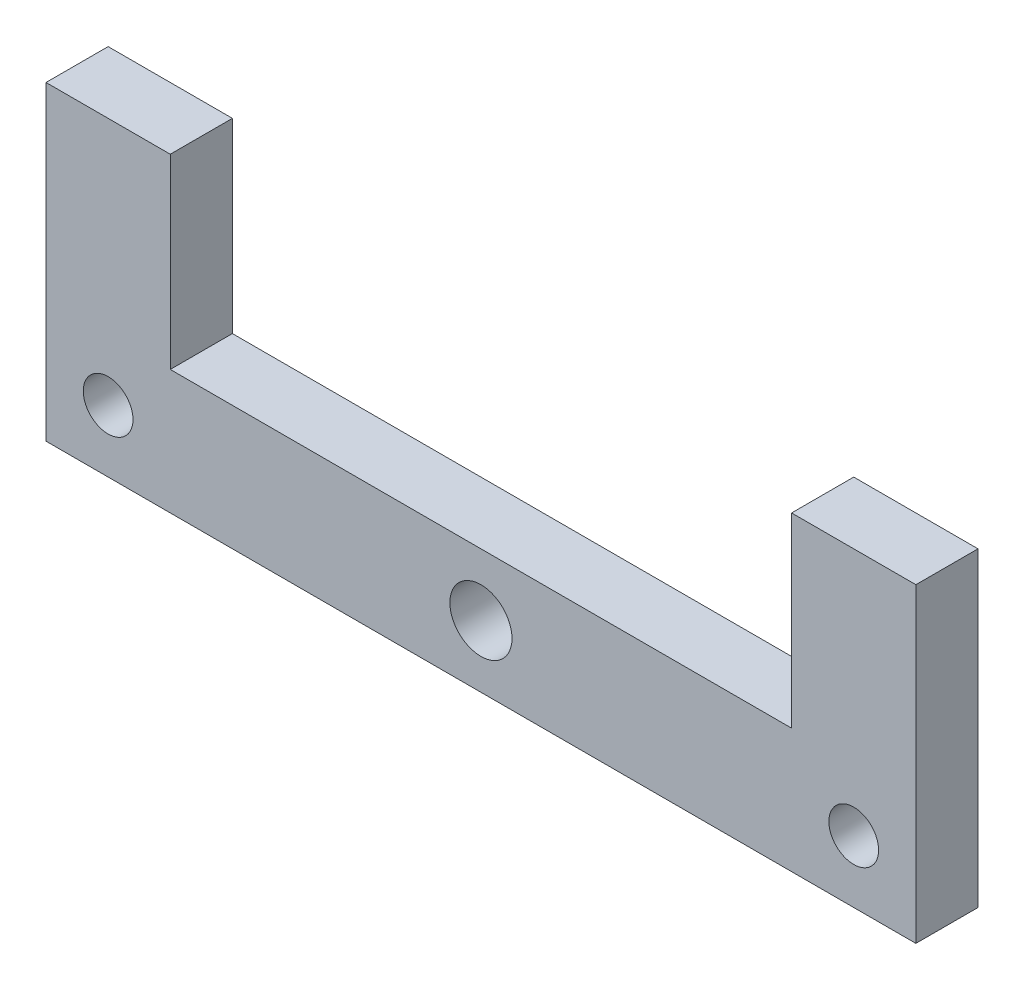
ISO-10303-21;
HEADER;
FILE_DESCRIPTION(('STEP AP214'),'2;1');
FILE_NAME('part.step','',(''),(''),'','','');
FILE_SCHEMA(('AUTOMOTIVE_DESIGN { 1 0 10303 214 1 1 1 1 }'));
ENDSEC;
DATA;
#1=APPLICATION_CONTEXT('core data for automotive mechanical design processes');
#2=APPLICATION_PROTOCOL_DEFINITION('international standard','automotive_design',2000,#1);
#3=PRODUCT_CONTEXT('',#1,'mechanical');
#4=PRODUCT('Part','Part','',(#3));
#5=PRODUCT_RELATED_PRODUCT_CATEGORY('part','',(#4));
#6=PRODUCT_DEFINITION_FORMATION('','',#4);
#7=PRODUCT_DEFINITION_CONTEXT('part definition',#1,'design');
#8=PRODUCT_DEFINITION('design','',#6,#7);
#9=PRODUCT_DEFINITION_SHAPE('','',#8);
#10=(LENGTH_UNIT() NAMED_UNIT(*) SI_UNIT(.MILLI.,.METRE.));
#11=(NAMED_UNIT(*) PLANE_ANGLE_UNIT() SI_UNIT($,.RADIAN.));
#12=(NAMED_UNIT(*) SI_UNIT($,.STERADIAN.) SOLID_ANGLE_UNIT());
#13=UNCERTAINTY_MEASURE_WITH_UNIT(LENGTH_MEASURE(1.E-05),#10,'distance_accuracy_value','');
#14=(GEOMETRIC_REPRESENTATION_CONTEXT(3) GLOBAL_UNCERTAINTY_ASSIGNED_CONTEXT((#13)) GLOBAL_UNIT_ASSIGNED_CONTEXT((#10,
#11,#12)) REPRESENTATION_CONTEXT('',''));
#15=CARTESIAN_POINT('',(0.,0.,0.));
#16=DIRECTION('',(0.,0.,1.));
#17=DIRECTION('',(1.,0.,0.));
#18=AXIS2_PLACEMENT_3D('',#15,#16,#17);
#19=CARTESIAN_POINT('',(50.,-100.772299585195,10.));
#20=DIRECTION('',(-1.,0.,0.));
#21=DIRECTION('',(0.,0.,1.));
#22=AXIS2_PLACEMENT_3D('',#19,#20,#21);
#23=PLANE('',#22);
#24=DIRECTION('',(0.,1.,0.));
#25=VECTOR('',#24,1.);
#26=CARTESIAN_POINT('',(50.,-100.772299585195,0.));
#27=LINE('',#26,#25);
#28=CARTESIAN_POINT('',(50.,9.99999999999998,0.));
#29=VERTEX_POINT('',#28);
#30=CARTESIAN_POINT('',(50.,40.,0.));
#31=VERTEX_POINT('',#30);
#32=EDGE_CURVE('E138',#29,#31,#27,.T.);
#33=ORIENTED_EDGE('',*,*,#32,.F.);
#34=DIRECTION('',(0.,0.,-1.));
#35=VECTOR('',#34,1.);
#36=CARTESIAN_POINT('',(50.,9.99999999999998,10.));
#37=LINE('',#36,#35);
#38=CARTESIAN_POINT('',(50.,9.99999999999998,10.));
#39=VERTEX_POINT('',#38);
#40=EDGE_CURVE('E11',#39,#29,#37,.T.);
#41=ORIENTED_EDGE('',*,*,#40,.F.);
#42=DIRECTION('',(0.,1.,0.));
#43=VECTOR('',#42,1.);
#44=CARTESIAN_POINT('',(50.,-100.772299585195,10.));
#45=LINE('',#44,#43);
#46=CARTESIAN_POINT('',(50.,40.,10.));
#47=VERTEX_POINT('',#46);
#48=EDGE_CURVE('E181',#39,#47,#45,.T.);
#49=ORIENTED_EDGE('',*,*,#48,.T.);
#50=DIRECTION('',(0.,0.,-1.));
#51=VECTOR('',#50,1.);
#52=CARTESIAN_POINT('',(50.,40.,10.));
#53=LINE('',#52,#51);
#54=EDGE_CURVE('E86',#47,#31,#53,.T.);
#55=ORIENTED_EDGE('',*,*,#54,.T.);
#56=EDGE_LOOP('',(#33,#41,#49,#55));
#57=FACE_BOUND('',#56,.T.);
#58=ADVANCED_FACE('F35',(#57),#23,.T.);
#59=CARTESIAN_POINT('',(0.,9.99999999999998,10.));
#60=DIRECTION('',(0.,1.,0.));
#61=DIRECTION('',(-1.,0.,0.));
#62=AXIS2_PLACEMENT_3D('',#59,#60,#61);
#63=PLANE('',#62);
#64=DIRECTION('',(1.,0.,0.));
#65=VECTOR('',#64,1.);
#66=CARTESIAN_POINT('',(0.,9.99999999999998,0.));
#67=LINE('',#66,#65);
#68=CARTESIAN_POINT('',(-50.,9.99999999999998,0.));
#69=VERTEX_POINT('',#68);
#70=EDGE_CURVE('E141',#69,#29,#67,.T.);
#71=ORIENTED_EDGE('',*,*,#70,.F.);
#72=DIRECTION('',(0.,0.,-1.));
#73=VECTOR('',#72,1.);
#74=CARTESIAN_POINT('',(-50.,9.99999999999998,10.));
#75=LINE('',#74,#73);
#76=CARTESIAN_POINT('',(-50.,9.99999999999998,10.));
#77=VERTEX_POINT('',#76);
#78=EDGE_CURVE('E44',#77,#69,#75,.T.);
#79=ORIENTED_EDGE('',*,*,#78,.F.);
#80=DIRECTION('',(1.,0.,0.));
#81=VECTOR('',#80,1.);
#82=CARTESIAN_POINT('',(0.,9.99999999999998,10.));
#83=LINE('',#82,#81);
#84=EDGE_CURVE('E179',#77,#39,#83,.T.);
#85=ORIENTED_EDGE('',*,*,#84,.T.);
#86=ORIENTED_EDGE('',*,*,#40,.T.);
#87=EDGE_LOOP('',(#71,#79,#85,#86));
#88=FACE_BOUND('',#87,.T.);
#89=ADVANCED_FACE('F178',(#88),#63,.T.);
#90=CARTESIAN_POINT('',(-50.,-100.772299585195,10.));
#91=DIRECTION('',(-1.,0.,0.));
#92=DIRECTION('',(0.,0.,1.));
#93=AXIS2_PLACEMENT_3D('',#90,#91,#92);
#94=PLANE('',#93);
#95=DIRECTION('',(0.,1.,0.));
#96=VECTOR('',#95,1.);
#97=CARTESIAN_POINT('',(-50.,-100.772299585195,0.));
#98=LINE('',#97,#96);
#99=CARTESIAN_POINT('',(-50.,40.,0.));
#100=VERTEX_POINT('',#99);
#101=EDGE_CURVE('E144',#69,#100,#98,.T.);
#102=ORIENTED_EDGE('',*,*,#101,.T.);
#103=DIRECTION('',(0.,0.,-1.));
#104=VECTOR('',#103,1.);
#105=CARTESIAN_POINT('',(-50.,40.,10.));
#106=LINE('',#105,#104);
#107=CARTESIAN_POINT('',(-50.,40.,10.));
#108=VERTEX_POINT('',#107);
#109=EDGE_CURVE('E164',#108,#100,#106,.T.);
#110=ORIENTED_EDGE('',*,*,#109,.F.);
#111=DIRECTION('',(0.,1.,0.));
#112=VECTOR('',#111,1.);
#113=CARTESIAN_POINT('',(-50.,-100.772299585195,10.));
#114=LINE('',#113,#112);
#115=EDGE_CURVE('E170',#77,#108,#114,.T.);
#116=ORIENTED_EDGE('',*,*,#115,.F.);
#117=ORIENTED_EDGE('',*,*,#78,.T.);
#118=EDGE_LOOP('',(#102,#110,#116,#117));
#119=FACE_BOUND('',#118,.T.);
#120=ADVANCED_FACE('F168',(#119),#94,.F.);
#121=CARTESIAN_POINT('',(0.,40.,10.));
#122=DIRECTION('',(0.,1.,0.));
#123=DIRECTION('',(0.,0.,1.));
#124=AXIS2_PLACEMENT_3D('',#121,#122,#123);
#125=PLANE('',#124);
#126=DIRECTION('',(1.,0.,0.));
#127=VECTOR('',#126,1.);
#128=CARTESIAN_POINT('',(0.,40.,0.));
#129=LINE('',#128,#127);
#130=CARTESIAN_POINT('',(-70.,40.,0.));
#131=VERTEX_POINT('',#130);
#132=EDGE_CURVE('E147',#131,#100,#129,.T.);
#133=ORIENTED_EDGE('',*,*,#132,.F.);
#134=DIRECTION('',(0.,0.,-1.));
#135=VECTOR('',#134,1.);
#136=CARTESIAN_POINT('',(-70.,40.,10.));
#137=LINE('',#136,#135);
#138=CARTESIAN_POINT('',(-70.,40.,10.));
#139=VERTEX_POINT('',#138);
#140=EDGE_CURVE('E162',#139,#131,#137,.T.);
#141=ORIENTED_EDGE('',*,*,#140,.F.);
#142=DIRECTION('',(1.,0.,0.));
#143=VECTOR('',#142,1.);
#144=CARTESIAN_POINT('',(0.,40.,10.));
#145=LINE('',#144,#143);
#146=EDGE_CURVE('E191',#139,#108,#145,.T.);
#147=ORIENTED_EDGE('',*,*,#146,.T.);
#148=ORIENTED_EDGE('',*,*,#109,.T.);
#149=EDGE_LOOP('',(#133,#141,#147,#148));
#150=FACE_BOUND('',#149,.T.);
#151=ADVANCED_FACE('F197',(#150),#125,.T.);
#152=CARTESIAN_POINT('',(-70.,-100.772299585195,10.));
#153=DIRECTION('',(-1.,0.,0.));
#154=DIRECTION('',(0.,0.,1.));
#155=AXIS2_PLACEMENT_3D('',#152,#153,#154);
#156=PLANE('',#155);
#157=DIRECTION('',(0.,1.,0.));
#158=VECTOR('',#157,1.);
#159=CARTESIAN_POINT('',(-70.,-100.772299585195,0.));
#160=LINE('',#159,#158);
#161=CARTESIAN_POINT('',(-70.,-10.,0.));
#162=VERTEX_POINT('',#161);
#163=EDGE_CURVE('E150',#162,#131,#160,.T.);
#164=ORIENTED_EDGE('',*,*,#163,.F.);
#165=DIRECTION('',(0.,0.,-1.));
#166=VECTOR('',#165,1.);
#167=CARTESIAN_POINT('',(-70.,-10.,10.));
#168=LINE('',#167,#166);
#169=CARTESIAN_POINT('',(-70.,-10.,10.));
#170=VERTEX_POINT('',#169);
#171=EDGE_CURVE('E122',#170,#162,#168,.T.);
#172=ORIENTED_EDGE('',*,*,#171,.F.);
#173=DIRECTION('',(0.,1.,0.));
#174=VECTOR('',#173,1.);
#175=CARTESIAN_POINT('',(-70.,-100.772299585195,10.));
#176=LINE('',#175,#174);
#177=EDGE_CURVE('E111',#170,#139,#176,.T.);
#178=ORIENTED_EDGE('',*,*,#177,.T.);
#179=ORIENTED_EDGE('',*,*,#140,.T.);
#180=EDGE_LOOP('',(#164,#172,#178,#179));
#181=FACE_BOUND('',#180,.T.);
#182=ADVANCED_FACE('F195',(#181),#156,.T.);
#183=CARTESIAN_POINT('',(0.,-10.,10.));
#184=DIRECTION('',(0.,1.,0.));
#185=DIRECTION('',(0.,0.,1.));
#186=AXIS2_PLACEMENT_3D('',#183,#184,#185);
#187=PLANE('',#186);
#188=DIRECTION('',(1.,0.,0.));
#189=VECTOR('',#188,1.);
#190=CARTESIAN_POINT('',(0.,-10.,0.));
#191=LINE('',#190,#189);
#192=CARTESIAN_POINT('',(70.,-10.,0.));
#193=VERTEX_POINT('',#192);
#194=EDGE_CURVE('E118',#162,#193,#191,.T.);
#195=ORIENTED_EDGE('',*,*,#194,.T.);
#196=DIRECTION('',(0.,0.,-1.));
#197=VECTOR('',#196,1.);
#198=CARTESIAN_POINT('',(70.,-10.,10.));
#199=LINE('',#198,#197);
#200=CARTESIAN_POINT('',(70.,-10.,10.));
#201=VERTEX_POINT('',#200);
#202=EDGE_CURVE('E115',#201,#193,#199,.T.);
#203=ORIENTED_EDGE('',*,*,#202,.F.);
#204=DIRECTION('',(1.,0.,0.));
#205=VECTOR('',#204,1.);
#206=CARTESIAN_POINT('',(0.,-10.,10.));
#207=LINE('',#206,#205);
#208=EDGE_CURVE('E104',#170,#201,#207,.T.);
#209=ORIENTED_EDGE('',*,*,#208,.F.);
#210=ORIENTED_EDGE('',*,*,#171,.T.);
#211=EDGE_LOOP('',(#195,#203,#209,#210));
#212=FACE_BOUND('',#211,.T.);
#213=ADVANCED_FACE('F116',(#212),#187,.F.);
#214=CARTESIAN_POINT('',(70.,-100.772299585195,10.));
#215=DIRECTION('',(1.,0.,0.));
#216=DIRECTION('',(0.,0.,-1.));
#217=AXIS2_PLACEMENT_3D('',#214,#215,#216);
#218=PLANE('',#217);
#219=DIRECTION('',(0.,-1.,0.));
#220=VECTOR('',#219,1.);
#221=CARTESIAN_POINT('',(70.,-100.772299585195,0.));
#222=LINE('',#221,#220);
#223=CARTESIAN_POINT('',(70.,40.,0.));
#224=VERTEX_POINT('',#223);
#225=EDGE_CURVE('E154',#224,#193,#222,.T.);
#226=ORIENTED_EDGE('',*,*,#225,.F.);
#227=DIRECTION('',(0.,0.,-1.));
#228=VECTOR('',#227,1.);
#229=CARTESIAN_POINT('',(70.,40.,10.));
#230=LINE('',#229,#228);
#231=CARTESIAN_POINT('',(70.,40.,10.));
#232=VERTEX_POINT('',#231);
#233=EDGE_CURVE('E79',#232,#224,#230,.T.);
#234=ORIENTED_EDGE('',*,*,#233,.F.);
#235=DIRECTION('',(0.,-1.,0.));
#236=VECTOR('',#235,1.);
#237=CARTESIAN_POINT('',(70.,-100.772299585195,10.));
#238=LINE('',#237,#236);
#239=EDGE_CURVE('E108',#232,#201,#238,.T.);
#240=ORIENTED_EDGE('',*,*,#239,.T.);
#241=ORIENTED_EDGE('',*,*,#202,.T.);
#242=EDGE_LOOP('',(#226,#234,#240,#241));
#243=FACE_BOUND('',#242,.T.);
#244=ADVANCED_FACE('F124',(#243),#218,.T.);
#245=CARTESIAN_POINT('',(0.,0.,10.));
#246=DIRECTION('',(0.,0.,-1.));
#247=DIRECTION('',(-1.,0.,0.));
#248=AXIS2_PLACEMENT_3D('',#245,#246,#247);
#249=CYLINDRICAL_SURFACE('',#248,5.);
#250=CARTESIAN_POINT('',(0.,0.,10.));
#251=DIRECTION('',(0.,0.,1.));
#252=DIRECTION('',(1.,0.,0.));
#253=AXIS2_PLACEMENT_3D('',#250,#251,#252);
#254=CIRCLE('',#253,5.);
#255=CARTESIAN_POINT('',(5.,0.,10.));
#256=VERTEX_POINT('',#255);
#257=EDGE_CURVE('E182',#256,#256,#254,.T.);
#258=ORIENTED_EDGE('',*,*,#257,.T.);
#259=EDGE_LOOP('',(#258));
#260=FACE_BOUND('',#259,.T.);
#261=CARTESIAN_POINT('',(0.,0.,0.));
#262=DIRECTION('',(0.,0.,1.));
#263=DIRECTION('',(1.,0.,0.));
#264=AXIS2_PLACEMENT_3D('',#261,#262,#263);
#265=CIRCLE('',#264,5.);
#266=CARTESIAN_POINT('',(5.,0.,0.));
#267=VERTEX_POINT('',#266);
#268=EDGE_CURVE('E135',#267,#267,#265,.T.);
#269=ORIENTED_EDGE('',*,*,#268,.F.);
#270=EDGE_LOOP('',(#269));
#271=FACE_BOUND('',#270,.T.);
#272=ADVANCED_FACE('F213',(#260,#271),#249,.F.);
#273=CARTESIAN_POINT('',(-60.,0.,10.));
#274=DIRECTION('',(0.,0.,-1.));
#275=DIRECTION('',(-1.,0.,0.));
#276=AXIS2_PLACEMENT_3D('',#273,#274,#275);
#277=CYLINDRICAL_SURFACE('',#276,3.99999999999999);
#278=CARTESIAN_POINT('',(-60.,0.,10.));
#279=DIRECTION('',(0.,0.,1.));
#280=DIRECTION('',(1.,0.,0.));
#281=AXIS2_PLACEMENT_3D('',#278,#279,#280);
#282=CIRCLE('',#281,3.99999999999999);
#283=CARTESIAN_POINT('',(-56.,0.,10.));
#284=VERTEX_POINT('',#283);
#285=EDGE_CURVE('E186',#284,#284,#282,.T.);
#286=ORIENTED_EDGE('',*,*,#285,.T.);
#287=EDGE_LOOP('',(#286));
#288=FACE_BOUND('',#287,.T.);
#289=CARTESIAN_POINT('',(-60.,0.,0.));
#290=DIRECTION('',(0.,0.,1.));
#291=DIRECTION('',(1.,0.,0.));
#292=AXIS2_PLACEMENT_3D('',#289,#290,#291);
#293=CIRCLE('',#292,3.99999999999999);
#294=CARTESIAN_POINT('',(-56.,0.,0.));
#295=VERTEX_POINT('',#294);
#296=EDGE_CURVE('E132',#295,#295,#293,.T.);
#297=ORIENTED_EDGE('',*,*,#296,.F.);
#298=EDGE_LOOP('',(#297));
#299=FACE_BOUND('',#298,.T.);
#300=ADVANCED_FACE('F215',(#288,#299),#277,.F.);
#301=CARTESIAN_POINT('',(60.,0.,10.));
#302=DIRECTION('',(0.,0.,-1.));
#303=DIRECTION('',(-1.,0.,0.));
#304=AXIS2_PLACEMENT_3D('',#301,#302,#303);
#305=CYLINDRICAL_SURFACE('',#304,4.00000000000001);
#306=CARTESIAN_POINT('',(60.,0.,10.));
#307=DIRECTION('',(0.,0.,1.));
#308=DIRECTION('',(1.,0.,0.));
#309=AXIS2_PLACEMENT_3D('',#306,#307,#308);
#310=CIRCLE('',#309,4.00000000000001);
#311=CARTESIAN_POINT('',(64.,0.,10.));
#312=VERTEX_POINT('',#311);
#313=EDGE_CURVE('E158',#312,#312,#310,.T.);
#314=ORIENTED_EDGE('',*,*,#313,.T.);
#315=EDGE_LOOP('',(#314));
#316=FACE_BOUND('',#315,.T.);
#317=CARTESIAN_POINT('',(60.,0.,0.));
#318=DIRECTION('',(0.,0.,1.));
#319=DIRECTION('',(1.,0.,0.));
#320=AXIS2_PLACEMENT_3D('',#317,#318,#319);
#321=CIRCLE('',#320,4.00000000000001);
#322=CARTESIAN_POINT('',(64.,0.,0.));
#323=VERTEX_POINT('',#322);
#324=EDGE_CURVE('E129',#323,#323,#321,.T.);
#325=ORIENTED_EDGE('',*,*,#324,.F.);
#326=EDGE_LOOP('',(#325));
#327=FACE_BOUND('',#326,.T.);
#328=ADVANCED_FACE('F37',(#316,#327),#305,.F.);
#329=CARTESIAN_POINT('',(0.,40.,10.));
#330=DIRECTION('',(0.,-1.,0.));
#331=DIRECTION('',(1.,0.,0.));
#332=AXIS2_PLACEMENT_3D('',#329,#330,#331);
#333=PLANE('',#332);
#334=DIRECTION('',(-1.,0.,0.));
#335=VECTOR('',#334,1.);
#336=CARTESIAN_POINT('',(0.,40.,0.));
#337=LINE('',#336,#335);
#338=EDGE_CURVE('E156',#224,#31,#337,.T.);
#339=ORIENTED_EDGE('',*,*,#338,.T.);
#340=ORIENTED_EDGE('',*,*,#54,.F.);
#341=DIRECTION('',(-1.,0.,0.));
#342=VECTOR('',#341,1.);
#343=CARTESIAN_POINT('',(0.,40.,10.));
#344=LINE('',#343,#342);
#345=EDGE_CURVE('E52',#232,#47,#344,.T.);
#346=ORIENTED_EDGE('',*,*,#345,.F.);
#347=ORIENTED_EDGE('',*,*,#233,.T.);
#348=EDGE_LOOP('',(#339,#340,#346,#347));
#349=FACE_BOUND('',#348,.T.);
#350=ADVANCED_FACE('F180',(#349),#333,.F.);
#351=CARTESIAN_POINT('',(0.,-100.772299585195,10.));
#352=DIRECTION('',(0.,0.,1.));
#353=DIRECTION('',(1.,0.,0.));
#354=AXIS2_PLACEMENT_3D('',#351,#352,#353);
#355=PLANE('',#354);
#356=ORIENTED_EDGE('',*,*,#313,.F.);
#357=EDGE_LOOP('',(#356));
#358=FACE_BOUND('',#357,.T.);
#359=ORIENTED_EDGE('',*,*,#285,.F.);
#360=EDGE_LOOP('',(#359));
#361=FACE_BOUND('',#360,.T.);
#362=ORIENTED_EDGE('',*,*,#257,.F.);
#363=EDGE_LOOP('',(#362));
#364=FACE_BOUND('',#363,.T.);
#365=ORIENTED_EDGE('',*,*,#48,.F.);
#366=ORIENTED_EDGE('',*,*,#84,.F.);
#367=ORIENTED_EDGE('',*,*,#115,.T.);
#368=ORIENTED_EDGE('',*,*,#146,.F.);
#369=ORIENTED_EDGE('',*,*,#177,.F.);
#370=ORIENTED_EDGE('',*,*,#208,.T.);
#371=ORIENTED_EDGE('',*,*,#239,.F.);
#372=ORIENTED_EDGE('',*,*,#345,.T.);
#373=EDGE_LOOP('',(#365,#366,#367,#368,#369,#370,#371,#372));
#374=FACE_BOUND('',#373,.T.);
#375=ADVANCED_FACE('F106',(#358,#361,#364,#374),#355,.T.);
#376=CARTESIAN_POINT('',(0.,-100.772299585195,0.));
#377=DIRECTION('',(0.,0.,1.));
#378=DIRECTION('',(1.,0.,0.));
#379=AXIS2_PLACEMENT_3D('',#376,#377,#378);
#380=PLANE('',#379);
#381=ORIENTED_EDGE('',*,*,#324,.T.);
#382=EDGE_LOOP('',(#381));
#383=FACE_BOUND('',#382,.T.);
#384=ORIENTED_EDGE('',*,*,#296,.T.);
#385=EDGE_LOOP('',(#384));
#386=FACE_BOUND('',#385,.T.);
#387=ORIENTED_EDGE('',*,*,#268,.T.);
#388=EDGE_LOOP('',(#387));
#389=FACE_BOUND('',#388,.T.);
#390=ORIENTED_EDGE('',*,*,#32,.T.);
#391=ORIENTED_EDGE('',*,*,#338,.F.);
#392=ORIENTED_EDGE('',*,*,#225,.T.);
#393=ORIENTED_EDGE('',*,*,#194,.F.);
#394=ORIENTED_EDGE('',*,*,#163,.T.);
#395=ORIENTED_EDGE('',*,*,#132,.T.);
#396=ORIENTED_EDGE('',*,*,#101,.F.);
#397=ORIENTED_EDGE('',*,*,#70,.T.);
#398=EDGE_LOOP('',(#390,#391,#392,#393,#394,#395,#396,#397));
#399=FACE_BOUND('',#398,.T.);
#400=ADVANCED_FACE('F176',(#383,#386,#389,#399),#380,.F.);
#401=CLOSED_SHELL('',(#58,#89,#120,#151,#182,#213,#244,#272,#300,#328,#350,#375,#400));
#402=MANIFOLD_SOLID_BREP('B2',#401);
#403=ADVANCED_BREP_SHAPE_REPRESENTATION('',(#18,#402),#14);
#404=SHAPE_DEFINITION_REPRESENTATION(#9,#403);
ENDSEC;
END-ISO-10303-21;
